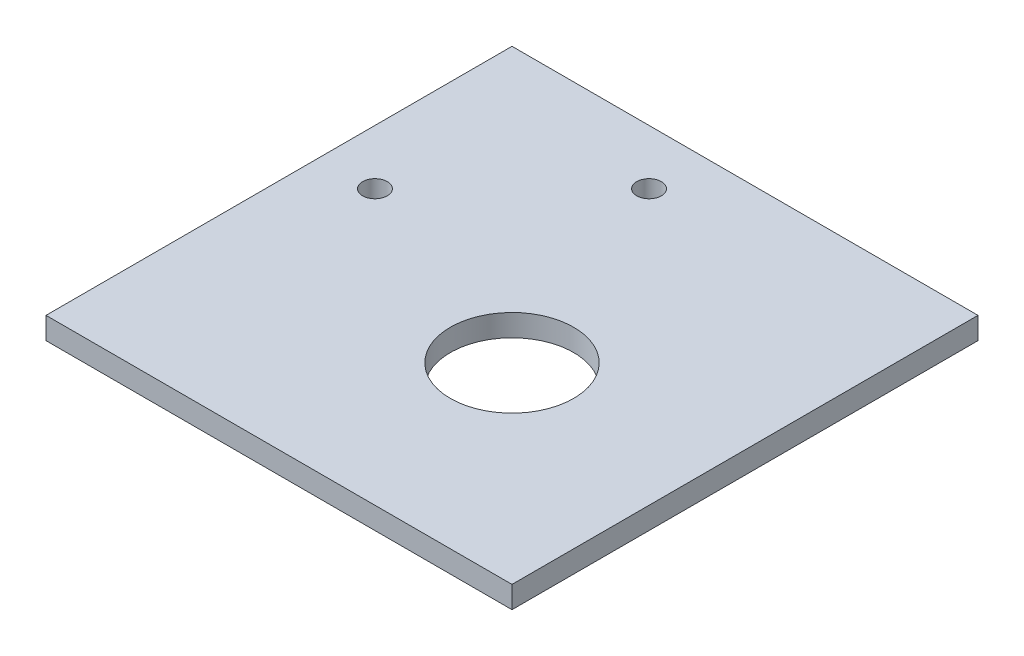
ISO-10303-21;
HEADER;
FILE_DESCRIPTION(('STEP AP214'),'2;1');
FILE_NAME('part.step','',(''),(''),'','','');
FILE_SCHEMA(('AUTOMOTIVE_DESIGN { 1 0 10303 214 1 1 1 1 }'));
ENDSEC;
DATA;
#1=APPLICATION_CONTEXT('core data for automotive mechanical design processes');
#2=APPLICATION_PROTOCOL_DEFINITION('international standard','automotive_design',2000,#1);
#3=PRODUCT_CONTEXT('',#1,'mechanical');
#4=PRODUCT('Part','Part','',(#3));
#5=PRODUCT_RELATED_PRODUCT_CATEGORY('part','',(#4));
#6=PRODUCT_DEFINITION_FORMATION('','',#4);
#7=PRODUCT_DEFINITION_CONTEXT('part definition',#1,'design');
#8=PRODUCT_DEFINITION('design','',#6,#7);
#9=PRODUCT_DEFINITION_SHAPE('','',#8);
#10=(LENGTH_UNIT() NAMED_UNIT(*) SI_UNIT(.MILLI.,.METRE.));
#11=(NAMED_UNIT(*) PLANE_ANGLE_UNIT() SI_UNIT($,.RADIAN.));
#12=(NAMED_UNIT(*) SI_UNIT($,.STERADIAN.) SOLID_ANGLE_UNIT());
#13=UNCERTAINTY_MEASURE_WITH_UNIT(LENGTH_MEASURE(1.E-05),#10,'distance_accuracy_value','');
#14=(GEOMETRIC_REPRESENTATION_CONTEXT(3) GLOBAL_UNCERTAINTY_ASSIGNED_CONTEXT((#13)) GLOBAL_UNIT_ASSIGNED_CONTEXT((#10,
#11,#12)) REPRESENTATION_CONTEXT('',''));
#15=CARTESIAN_POINT('',(0.,0.,0.));
#16=DIRECTION('',(0.,0.,1.));
#17=DIRECTION('',(1.,0.,0.));
#18=AXIS2_PLACEMENT_3D('',#15,#16,#17);
#19=CARTESIAN_POINT('',(0.,4.,0.));
#20=DIRECTION('',(0.,1.,0.));
#21=DIRECTION('',(0.,0.,1.));
#22=AXIS2_PLACEMENT_3D('',#19,#20,#21);
#23=PLANE('',#22);
#24=CARTESIAN_POINT('',(-15.,4.,-40.));
#25=DIRECTION('',(0.,1.,0.));
#26=DIRECTION('',(0.,0.,1.));
#27=AXIS2_PLACEMENT_3D('',#24,#25,#26);
#28=CIRCLE('',#27,2.25);
#29=CARTESIAN_POINT('',(-15.,4.,-37.75));
#30=VERTEX_POINT('',#29);
#31=EDGE_CURVE('E134',#30,#30,#28,.T.);
#32=ORIENTED_EDGE('',*,*,#31,.F.);
#33=EDGE_LOOP('',(#32));
#34=FACE_BOUND('',#33,.T.);
#35=DIRECTION('',(0.,0.,1.));
#36=VECTOR('',#35,1.);
#37=CARTESIAN_POINT('',(-50.,4.,-50.));
#38=LINE('',#37,#36);
#39=CARTESIAN_POINT('',(-50.,4.,-50.));
#40=VERTEX_POINT('',#39);
#41=CARTESIAN_POINT('',(-50.,4.,35.));
#42=VERTEX_POINT('',#41);
#43=EDGE_CURVE('E92',#40,#42,#38,.T.);
#44=ORIENTED_EDGE('',*,*,#43,.T.);
#45=DIRECTION('',(1.,0.,0.));
#46=VECTOR('',#45,1.);
#47=CARTESIAN_POINT('',(-50.,4.,35.));
#48=LINE('',#47,#46);
#49=CARTESIAN_POINT('',(35.,4.,35.));
#50=VERTEX_POINT('',#49);
#51=EDGE_CURVE('E87',#42,#50,#48,.T.);
#52=ORIENTED_EDGE('',*,*,#51,.T.);
#53=DIRECTION('',(0.,0.,-1.));
#54=VECTOR('',#53,1.);
#55=CARTESIAN_POINT('',(35.,4.,-50.));
#56=LINE('',#55,#54);
#57=CARTESIAN_POINT('',(35.,4.,-50.));
#58=VERTEX_POINT('',#57);
#59=EDGE_CURVE('E90',#50,#58,#56,.T.);
#60=ORIENTED_EDGE('',*,*,#59,.T.);
#61=DIRECTION('',(-1.,0.,0.));
#62=VECTOR('',#61,1.);
#63=CARTESIAN_POINT('',(-50.,4.,-50.));
#64=LINE('',#63,#62);
#65=EDGE_CURVE('E57',#58,#40,#64,.T.);
#66=ORIENTED_EDGE('',*,*,#65,.T.);
#67=EDGE_LOOP('',(#44,#52,#60,#66));
#68=FACE_BOUND('',#67,.T.);
#69=CARTESIAN_POINT('',(0.,4.,0.));
#70=DIRECTION('',(0.,1.,0.));
#71=DIRECTION('',(0.,0.,1.));
#72=AXIS2_PLACEMENT_3D('',#69,#70,#71);
#73=CIRCLE('',#72,11.25);
#74=CARTESIAN_POINT('',(0.,4.,11.25));
#75=VERTEX_POINT('',#74);
#76=EDGE_CURVE('E112',#75,#75,#73,.T.);
#77=ORIENTED_EDGE('',*,*,#76,.F.);
#78=EDGE_LOOP('',(#77));
#79=FACE_BOUND('',#78,.T.);
#80=CARTESIAN_POINT('',(-40.,4.,-15.));
#81=DIRECTION('',(0.,1.,0.));
#82=DIRECTION('',(0.,0.,1.));
#83=AXIS2_PLACEMENT_3D('',#80,#81,#82);
#84=CIRCLE('',#83,2.25);
#85=CARTESIAN_POINT('',(-40.,4.,-12.75));
#86=VERTEX_POINT('',#85);
#87=EDGE_CURVE('E142',#86,#86,#84,.T.);
#88=ORIENTED_EDGE('',*,*,#87,.F.);
#89=EDGE_LOOP('',(#88));
#90=FACE_BOUND('',#89,.T.);
#91=ADVANCED_FACE('F39',(#34,#68,#79,#90),#23,.T.);
#92=CARTESIAN_POINT('',(0.,0.,0.));
#93=DIRECTION('',(0.,1.,0.));
#94=DIRECTION('',(0.,0.,1.));
#95=AXIS2_PLACEMENT_3D('',#92,#93,#94);
#96=PLANE('',#95);
#97=DIRECTION('',(0.,0.,1.));
#98=VECTOR('',#97,1.);
#99=CARTESIAN_POINT('',(-50.,0.,-50.));
#100=LINE('',#99,#98);
#101=CARTESIAN_POINT('',(-50.,0.,-50.));
#102=VERTEX_POINT('',#101);
#103=CARTESIAN_POINT('',(-50.,0.,35.));
#104=VERTEX_POINT('',#103);
#105=EDGE_CURVE('E108',#102,#104,#100,.T.);
#106=ORIENTED_EDGE('',*,*,#105,.F.);
#107=DIRECTION('',(-1.,0.,0.));
#108=VECTOR('',#107,1.);
#109=CARTESIAN_POINT('',(-50.,0.,-50.));
#110=LINE('',#109,#108);
#111=CARTESIAN_POINT('',(35.,0.,-50.));
#112=VERTEX_POINT('',#111);
#113=EDGE_CURVE('E80',#112,#102,#110,.T.);
#114=ORIENTED_EDGE('',*,*,#113,.F.);
#115=DIRECTION('',(0.,0.,-1.));
#116=VECTOR('',#115,1.);
#117=CARTESIAN_POINT('',(35.,0.,-50.));
#118=LINE('',#117,#116);
#119=CARTESIAN_POINT('',(35.,0.,35.));
#120=VERTEX_POINT('',#119);
#121=EDGE_CURVE('E74',#120,#112,#118,.T.);
#122=ORIENTED_EDGE('',*,*,#121,.F.);
#123=DIRECTION('',(1.,0.,0.));
#124=VECTOR('',#123,1.);
#125=CARTESIAN_POINT('',(-50.,0.,35.));
#126=LINE('',#125,#124);
#127=EDGE_CURVE('E97',#104,#120,#126,.T.);
#128=ORIENTED_EDGE('',*,*,#127,.F.);
#129=EDGE_LOOP('',(#106,#114,#122,#128));
#130=FACE_BOUND('',#129,.T.);
#131=CARTESIAN_POINT('',(0.,0.,0.));
#132=DIRECTION('',(0.,1.,0.));
#133=DIRECTION('',(0.,0.,1.));
#134=AXIS2_PLACEMENT_3D('',#131,#132,#133);
#135=CIRCLE('',#134,11.25);
#136=CARTESIAN_POINT('',(0.,0.,11.25));
#137=VERTEX_POINT('',#136);
#138=EDGE_CURVE('E130',#137,#137,#135,.T.);
#139=ORIENTED_EDGE('',*,*,#138,.T.);
#140=EDGE_LOOP('',(#139));
#141=FACE_BOUND('',#140,.T.);
#142=CARTESIAN_POINT('',(-15.,0.,-40.));
#143=DIRECTION('',(0.,1.,0.));
#144=DIRECTION('',(0.,0.,1.));
#145=AXIS2_PLACEMENT_3D('',#142,#143,#144);
#146=CIRCLE('',#145,2.25);
#147=CARTESIAN_POINT('',(-15.,0.,-37.75));
#148=VERTEX_POINT('',#147);
#149=EDGE_CURVE('E138',#148,#148,#146,.T.);
#150=ORIENTED_EDGE('',*,*,#149,.T.);
#151=EDGE_LOOP('',(#150));
#152=FACE_BOUND('',#151,.T.);
#153=CARTESIAN_POINT('',(-40.,0.,-15.));
#154=DIRECTION('',(0.,1.,0.));
#155=DIRECTION('',(0.,0.,1.));
#156=AXIS2_PLACEMENT_3D('',#153,#154,#155);
#157=CIRCLE('',#156,2.25);
#158=CARTESIAN_POINT('',(-40.,0.,-12.75));
#159=VERTEX_POINT('',#158);
#160=EDGE_CURVE('E146',#159,#159,#157,.T.);
#161=ORIENTED_EDGE('',*,*,#160,.T.);
#162=EDGE_LOOP('',(#161));
#163=FACE_BOUND('',#162,.T.);
#164=ADVANCED_FACE('F125',(#130,#141,#152,#163),#96,.F.);
#165=CARTESIAN_POINT('',(-50.,4.,-50.));
#166=DIRECTION('',(1.,0.,0.));
#167=DIRECTION('',(0.,0.,-1.));
#168=AXIS2_PLACEMENT_3D('',#165,#166,#167);
#169=PLANE('',#168);
#170=ORIENTED_EDGE('',*,*,#105,.T.);
#171=DIRECTION('',(0.,-1.,0.));
#172=VECTOR('',#171,1.);
#173=CARTESIAN_POINT('',(-50.,4.,35.));
#174=LINE('',#173,#172);
#175=EDGE_CURVE('E11',#42,#104,#174,.T.);
#176=ORIENTED_EDGE('',*,*,#175,.F.);
#177=ORIENTED_EDGE('',*,*,#43,.F.);
#178=DIRECTION('',(0.,-1.,0.));
#179=VECTOR('',#178,1.);
#180=CARTESIAN_POINT('',(-50.,4.,-50.));
#181=LINE('',#180,#179);
#182=EDGE_CURVE('E104',#40,#102,#181,.T.);
#183=ORIENTED_EDGE('',*,*,#182,.T.);
#184=EDGE_LOOP('',(#170,#176,#177,#183));
#185=FACE_BOUND('',#184,.T.);
#186=ADVANCED_FACE('F41',(#185),#169,.F.);
#187=CARTESIAN_POINT('',(-50.,4.,35.));
#188=DIRECTION('',(0.,0.,-1.));
#189=DIRECTION('',(-1.,0.,0.));
#190=AXIS2_PLACEMENT_3D('',#187,#188,#189);
#191=PLANE('',#190);
#192=ORIENTED_EDGE('',*,*,#127,.T.);
#193=DIRECTION('',(0.,-1.,0.));
#194=VECTOR('',#193,1.);
#195=CARTESIAN_POINT('',(35.,4.,35.));
#196=LINE('',#195,#194);
#197=EDGE_CURVE('E49',#50,#120,#196,.T.);
#198=ORIENTED_EDGE('',*,*,#197,.F.);
#199=ORIENTED_EDGE('',*,*,#51,.F.);
#200=ORIENTED_EDGE('',*,*,#175,.T.);
#201=EDGE_LOOP('',(#192,#198,#199,#200));
#202=FACE_BOUND('',#201,.T.);
#203=ADVANCED_FACE('F96',(#202),#191,.F.);
#204=CARTESIAN_POINT('',(35.,4.,-50.));
#205=DIRECTION('',(-1.,0.,0.));
#206=DIRECTION('',(0.,0.,1.));
#207=AXIS2_PLACEMENT_3D('',#204,#205,#206);
#208=PLANE('',#207);
#209=ORIENTED_EDGE('',*,*,#121,.T.);
#210=DIRECTION('',(0.,-1.,0.));
#211=VECTOR('',#210,1.);
#212=CARTESIAN_POINT('',(35.,4.,-50.));
#213=LINE('',#212,#211);
#214=EDGE_CURVE('E99',#58,#112,#213,.T.);
#215=ORIENTED_EDGE('',*,*,#214,.F.);
#216=ORIENTED_EDGE('',*,*,#59,.F.);
#217=ORIENTED_EDGE('',*,*,#197,.T.);
#218=EDGE_LOOP('',(#209,#215,#216,#217));
#219=FACE_BOUND('',#218,.T.);
#220=ADVANCED_FACE('F100',(#219),#208,.F.);
#221=CARTESIAN_POINT('',(-50.,4.,-50.));
#222=DIRECTION('',(0.,0.,1.));
#223=DIRECTION('',(1.,0.,0.));
#224=AXIS2_PLACEMENT_3D('',#221,#222,#223);
#225=PLANE('',#224);
#226=ORIENTED_EDGE('',*,*,#113,.T.);
#227=ORIENTED_EDGE('',*,*,#182,.F.);
#228=ORIENTED_EDGE('',*,*,#65,.F.);
#229=ORIENTED_EDGE('',*,*,#214,.T.);
#230=EDGE_LOOP('',(#226,#227,#228,#229));
#231=FACE_BOUND('',#230,.T.);
#232=ADVANCED_FACE('F122',(#231),#225,.F.);
#233=CARTESIAN_POINT('',(0.,4.,0.));
#234=DIRECTION('',(0.,-1.,0.));
#235=DIRECTION('',(0.,0.,-1.));
#236=AXIS2_PLACEMENT_3D('',#233,#234,#235);
#237=CYLINDRICAL_SURFACE('',#236,11.25);
#238=ORIENTED_EDGE('',*,*,#76,.T.);
#239=EDGE_LOOP('',(#238));
#240=FACE_BOUND('',#239,.T.);
#241=ORIENTED_EDGE('',*,*,#138,.F.);
#242=EDGE_LOOP('',(#241));
#243=FACE_BOUND('',#242,.T.);
#244=ADVANCED_FACE('F166',(#240,#243),#237,.F.);
#245=CARTESIAN_POINT('',(-15.,4.,-40.));
#246=DIRECTION('',(0.,-1.,0.));
#247=DIRECTION('',(0.,0.,-1.));
#248=AXIS2_PLACEMENT_3D('',#245,#246,#247);
#249=CYLINDRICAL_SURFACE('',#248,2.25);
#250=ORIENTED_EDGE('',*,*,#31,.T.);
#251=EDGE_LOOP('',(#250));
#252=FACE_BOUND('',#251,.T.);
#253=ORIENTED_EDGE('',*,*,#149,.F.);
#254=EDGE_LOOP('',(#253));
#255=FACE_BOUND('',#254,.T.);
#256=ADVANCED_FACE('F212',(#252,#255),#249,.F.);
#257=CARTESIAN_POINT('',(-40.,4.,-15.));
#258=DIRECTION('',(0.,-1.,0.));
#259=DIRECTION('',(0.,0.,-1.));
#260=AXIS2_PLACEMENT_3D('',#257,#258,#259);
#261=CYLINDRICAL_SURFACE('',#260,2.25);
#262=ORIENTED_EDGE('',*,*,#87,.T.);
#263=EDGE_LOOP('',(#262));
#264=FACE_BOUND('',#263,.T.);
#265=ORIENTED_EDGE('',*,*,#160,.F.);
#266=EDGE_LOOP('',(#265));
#267=FACE_BOUND('',#266,.T.);
#268=ADVANCED_FACE('F154',(#264,#267),#261,.F.);
#269=CLOSED_SHELL('',(#91,#164,#186,#203,#220,#232,#244,#256,#268));
#270=MANIFOLD_SOLID_BREP('B2',#269);
#271=ADVANCED_BREP_SHAPE_REPRESENTATION('',(#18,#270),#14);
#272=SHAPE_DEFINITION_REPRESENTATION(#9,#271);
ENDSEC;
END-ISO-10303-21;
